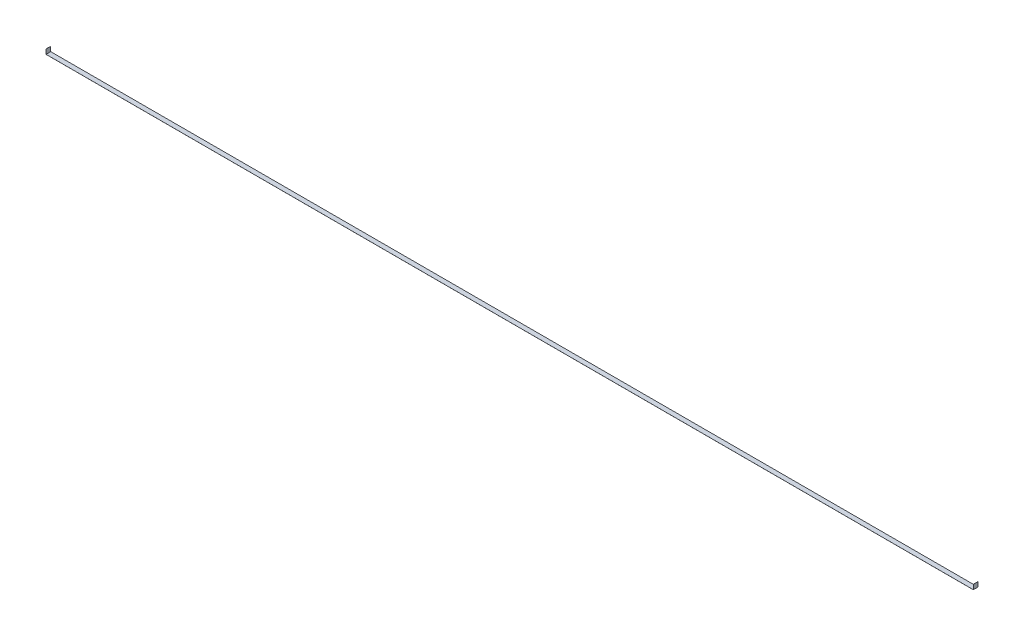
ISO-10303-21;
HEADER;
FILE_DESCRIPTION(('STEP AP214'),'2;1');
FILE_NAME('part.step','',(''),(''),'','','');
FILE_SCHEMA(('AUTOMOTIVE_DESIGN { 1 0 10303 214 1 1 1 1 }'));
ENDSEC;
DATA;
#1=APPLICATION_CONTEXT('core data for automotive mechanical design processes');
#2=APPLICATION_PROTOCOL_DEFINITION('international standard','automotive_design',2000,#1);
#3=PRODUCT_CONTEXT('',#1,'mechanical');
#4=PRODUCT('Part','Part','',(#3));
#5=PRODUCT_RELATED_PRODUCT_CATEGORY('part','',(#4));
#6=PRODUCT_DEFINITION_FORMATION('','',#4);
#7=PRODUCT_DEFINITION_CONTEXT('part definition',#1,'design');
#8=PRODUCT_DEFINITION('design','',#6,#7);
#9=PRODUCT_DEFINITION_SHAPE('','',#8);
#10=(LENGTH_UNIT() NAMED_UNIT(*) SI_UNIT(.MILLI.,.METRE.));
#11=(NAMED_UNIT(*) PLANE_ANGLE_UNIT() SI_UNIT($,.RADIAN.));
#12=(NAMED_UNIT(*) SI_UNIT($,.STERADIAN.) SOLID_ANGLE_UNIT());
#13=UNCERTAINTY_MEASURE_WITH_UNIT(LENGTH_MEASURE(1.E-05),#10,'distance_accuracy_value','');
#14=(GEOMETRIC_REPRESENTATION_CONTEXT(3) GLOBAL_UNCERTAINTY_ASSIGNED_CONTEXT((#13)) GLOBAL_UNIT_ASSIGNED_CONTEXT((#10,
#11,#12)) REPRESENTATION_CONTEXT('',''));
#15=CARTESIAN_POINT('',(0.,0.,0.));
#16=DIRECTION('',(0.,0.,1.));
#17=DIRECTION('',(1.,0.,0.));
#18=AXIS2_PLACEMENT_3D('',#15,#16,#17);
#19=CARTESIAN_POINT('',(-2527.3,0.,12.7));
#20=DIRECTION('',(-1.,0.,0.));
#21=DIRECTION('',(0.,0.,1.));
#22=AXIS2_PLACEMENT_3D('',#19,#20,#21);
#23=PLANE('',#22);
#24=DIRECTION('',(0.,1.,0.));
#25=VECTOR('',#24,1.);
#26=CARTESIAN_POINT('',(-2527.3,0.,-12.7));
#27=LINE('',#26,#25);
#28=CARTESIAN_POINT('',(-2527.3,0.,-12.7));
#29=VERTEX_POINT('',#28);
#30=CARTESIAN_POINT('',(-2527.3,25.4,-12.7));
#31=VERTEX_POINT('',#30);
#32=EDGE_CURVE('E134',#29,#31,#27,.T.);
#33=ORIENTED_EDGE('',*,*,#32,.T.);
#34=DIRECTION('',(0.,0.,-1.));
#35=VECTOR('',#34,1.);
#36=CARTESIAN_POINT('',(-2527.3,25.4,12.7));
#37=LINE('',#36,#35);
#38=CARTESIAN_POINT('',(-2527.3,25.4,12.7));
#39=VERTEX_POINT('',#38);
#40=EDGE_CURVE('E11',#39,#31,#37,.T.);
#41=ORIENTED_EDGE('',*,*,#40,.F.);
#42=DIRECTION('',(0.,1.,0.));
#43=VECTOR('',#42,1.);
#44=CARTESIAN_POINT('',(-2527.3,0.,12.7));
#45=LINE('',#44,#43);
#46=CARTESIAN_POINT('',(-2527.3,0.,12.7));
#47=VERTEX_POINT('',#46);
#48=EDGE_CURVE('E92',#47,#39,#45,.T.);
#49=ORIENTED_EDGE('',*,*,#48,.F.);
#50=DIRECTION('',(0.,0.,-1.));
#51=VECTOR('',#50,1.);
#52=CARTESIAN_POINT('',(-2527.3,0.,12.7));
#53=LINE('',#52,#51);
#54=EDGE_CURVE('E133',#47,#29,#53,.T.);
#55=ORIENTED_EDGE('',*,*,#54,.T.);
#56=EDGE_LOOP('',(#33,#41,#49,#55));
#57=FACE_BOUND('',#56,.T.);
#58=ADVANCED_FACE('F37',(#57),#23,.F.);
#59=CARTESIAN_POINT('',(-2527.554,25.4,12.7));
#60=DIRECTION('',(0.,1.,0.));
#61=DIRECTION('',(0.,0.,1.));
#62=AXIS2_PLACEMENT_3D('',#59,#60,#61);
#63=PLANE('',#62);
#64=DIRECTION('',(1.,0.,0.));
#65=VECTOR('',#64,1.);
#66=CARTESIAN_POINT('',(-2527.554,25.4,-12.7));
#67=LINE('',#66,#65);
#68=CARTESIAN_POINT('',(-2527.554,25.4,-12.7));
#69=VERTEX_POINT('',#68);
#70=EDGE_CURVE('E137',#69,#31,#67,.T.);
#71=ORIENTED_EDGE('',*,*,#70,.F.);
#72=DIRECTION('',(0.,0.,-1.));
#73=VECTOR('',#72,1.);
#74=CARTESIAN_POINT('',(-2527.554,25.4,12.7));
#75=LINE('',#74,#73);
#76=CARTESIAN_POINT('',(-2527.554,25.4,12.7));
#77=VERTEX_POINT('',#76);
#78=EDGE_CURVE('E45',#77,#69,#75,.T.);
#79=ORIENTED_EDGE('',*,*,#78,.F.);
#80=DIRECTION('',(1.,0.,0.));
#81=VECTOR('',#80,1.);
#82=CARTESIAN_POINT('',(-2527.554,25.4,12.7));
#83=LINE('',#82,#81);
#84=EDGE_CURVE('E176',#77,#39,#83,.T.);
#85=ORIENTED_EDGE('',*,*,#84,.T.);
#86=ORIENTED_EDGE('',*,*,#40,.T.);
#87=EDGE_LOOP('',(#71,#79,#85,#86));
#88=FACE_BOUND('',#87,.T.);
#89=ADVANCED_FACE('F167',(#88),#63,.T.);
#90=CARTESIAN_POINT('',(-2527.554,0.,12.7));
#91=DIRECTION('',(-1.,0.,0.));
#92=DIRECTION('',(0.,0.,1.));
#93=AXIS2_PLACEMENT_3D('',#90,#91,#92);
#94=PLANE('',#93);
#95=DIRECTION('',(0.,1.,0.));
#96=VECTOR('',#95,1.);
#97=CARTESIAN_POINT('',(-2527.554,0.,-12.7));
#98=LINE('',#97,#96);
#99=CARTESIAN_POINT('',(-2527.554,-0.254,-12.7));
#100=VERTEX_POINT('',#99);
#101=EDGE_CURVE('E140',#100,#69,#98,.T.);
#102=ORIENTED_EDGE('',*,*,#101,.F.);
#103=DIRECTION('',(0.,0.,-1.));
#104=VECTOR('',#103,1.);
#105=CARTESIAN_POINT('',(-2527.554,-0.254,12.7));
#106=LINE('',#105,#104);
#107=CARTESIAN_POINT('',(-2527.554,-0.254,12.7));
#108=VERTEX_POINT('',#107);
#109=EDGE_CURVE('E157',#108,#100,#106,.T.);
#110=ORIENTED_EDGE('',*,*,#109,.F.);
#111=DIRECTION('',(0.,1.,0.));
#112=VECTOR('',#111,1.);
#113=CARTESIAN_POINT('',(-2527.554,0.,12.7));
#114=LINE('',#113,#112);
#115=EDGE_CURVE('E164',#108,#77,#114,.T.);
#116=ORIENTED_EDGE('',*,*,#115,.T.);
#117=ORIENTED_EDGE('',*,*,#78,.T.);
#118=EDGE_LOOP('',(#102,#110,#116,#117));
#119=FACE_BOUND('',#118,.T.);
#120=ADVANCED_FACE('F162',(#119),#94,.T.);
#121=CARTESIAN_POINT('',(-2527.3,-0.254,12.7));
#122=DIRECTION('',(0.,-1.,0.));
#123=DIRECTION('',(1.,0.,0.));
#124=AXIS2_PLACEMENT_3D('',#121,#122,#123);
#125=PLANE('',#124);
#126=DIRECTION('',(-1.,0.,0.));
#127=VECTOR('',#126,1.);
#128=CARTESIAN_POINT('',(-2527.3,-0.254,-12.7));
#129=LINE('',#128,#127);
#130=CARTESIAN_POINT('',(2527.554,-0.253999999999071,-12.7));
#131=VERTEX_POINT('',#130);
#132=EDGE_CURVE('E143',#131,#100,#129,.T.);
#133=ORIENTED_EDGE('',*,*,#132,.F.);
#134=DIRECTION('',(0.,0.,-1.));
#135=VECTOR('',#134,1.);
#136=CARTESIAN_POINT('',(2527.554,-0.253999999999071,12.7));
#137=LINE('',#136,#135);
#138=CARTESIAN_POINT('',(2527.554,-0.253999999999071,12.7));
#139=VERTEX_POINT('',#138);
#140=EDGE_CURVE('E155',#139,#131,#137,.T.);
#141=ORIENTED_EDGE('',*,*,#140,.F.);
#142=DIRECTION('',(-1.,0.,0.));
#143=VECTOR('',#142,1.);
#144=CARTESIAN_POINT('',(-2527.3,-0.254,12.7));
#145=LINE('',#144,#143);
#146=EDGE_CURVE('E128',#139,#108,#145,.T.);
#147=ORIENTED_EDGE('',*,*,#146,.T.);
#148=ORIENTED_EDGE('',*,*,#109,.T.);
#149=EDGE_LOOP('',(#133,#141,#147,#148));
#150=FACE_BOUND('',#149,.T.);
#151=ADVANCED_FACE('F174',(#150),#125,.T.);
#152=CARTESIAN_POINT('',(2527.554,9.28514956645532E-13,12.7));
#153=DIRECTION('',(1.,0.,0.));
#154=DIRECTION('',(0.,0.,-1.));
#155=AXIS2_PLACEMENT_3D('',#152,#153,#154);
#156=PLANE('',#155);
#157=DIRECTION('',(0.,1.,0.));
#158=VECTOR('',#157,1.);
#159=CARTESIAN_POINT('',(2527.554,9.28514956645532E-13,-12.7));
#160=LINE('',#159,#158);
#161=CARTESIAN_POINT('',(2527.554,25.4000000000009,-12.7));
#162=VERTEX_POINT('',#161);
#163=EDGE_CURVE('E146',#162,#131,#160,.F.);
#164=ORIENTED_EDGE('',*,*,#163,.F.);
#165=DIRECTION('',(0.,0.,-1.));
#166=VECTOR('',#165,1.);
#167=CARTESIAN_POINT('',(2527.554,25.4000000000009,12.7));
#168=LINE('',#167,#166);
#169=CARTESIAN_POINT('',(2527.554,25.4000000000009,12.7));
#170=VERTEX_POINT('',#169);
#171=EDGE_CURVE('E116',#170,#162,#168,.T.);
#172=ORIENTED_EDGE('',*,*,#171,.F.);
#173=DIRECTION('',(0.,1.,0.));
#174=VECTOR('',#173,1.);
#175=CARTESIAN_POINT('',(2527.554,9.28514956645532E-13,12.7));
#176=LINE('',#175,#174);
#177=EDGE_CURVE('E126',#170,#139,#176,.F.);
#178=ORIENTED_EDGE('',*,*,#177,.T.);
#179=ORIENTED_EDGE('',*,*,#140,.T.);
#180=EDGE_LOOP('',(#164,#172,#178,#179));
#181=FACE_BOUND('',#180,.T.);
#182=ADVANCED_FACE('F181',(#181),#156,.T.);
#183=CARTESIAN_POINT('',(2527.3,25.4000000000009,12.7));
#184=DIRECTION('',(0.,1.,0.));
#185=DIRECTION('',(0.,0.,1.));
#186=AXIS2_PLACEMENT_3D('',#183,#184,#185);
#187=PLANE('',#186);
#188=DIRECTION('',(1.,0.,0.));
#189=VECTOR('',#188,1.);
#190=CARTESIAN_POINT('',(2527.3,25.4000000000009,-12.7));
#191=LINE('',#190,#189);
#192=CARTESIAN_POINT('',(2527.3,25.4000000000009,-12.7));
#193=VERTEX_POINT('',#192);
#194=EDGE_CURVE('E115',#193,#162,#191,.T.);
#195=ORIENTED_EDGE('',*,*,#194,.F.);
#196=DIRECTION('',(0.,0.,-1.));
#197=VECTOR('',#196,1.);
#198=CARTESIAN_POINT('',(2527.3,25.4000000000009,12.7));
#199=LINE('',#198,#197);
#200=CARTESIAN_POINT('',(2527.3,25.4000000000009,12.7));
#201=VERTEX_POINT('',#200);
#202=EDGE_CURVE('E109',#201,#193,#199,.T.);
#203=ORIENTED_EDGE('',*,*,#202,.F.);
#204=DIRECTION('',(1.,0.,0.));
#205=VECTOR('',#204,1.);
#206=CARTESIAN_POINT('',(2527.3,25.4000000000009,12.7));
#207=LINE('',#206,#205);
#208=EDGE_CURVE('E113',#201,#170,#207,.T.);
#209=ORIENTED_EDGE('',*,*,#208,.T.);
#210=ORIENTED_EDGE('',*,*,#171,.T.);
#211=EDGE_LOOP('',(#195,#203,#209,#210));
#212=FACE_BOUND('',#211,.T.);
#213=ADVANCED_FACE('F111',(#212),#187,.T.);
#214=CARTESIAN_POINT('',(2527.3,9.28514956645532E-13,12.7));
#215=DIRECTION('',(1.,0.,0.));
#216=DIRECTION('',(0.,0.,-1.));
#217=AXIS2_PLACEMENT_3D('',#214,#215,#216);
#218=PLANE('',#217);
#219=DIRECTION('',(0.,-1.,0.));
#220=VECTOR('',#219,1.);
#221=CARTESIAN_POINT('',(2527.3,9.28514956645532E-13,-12.7));
#222=LINE('',#221,#220);
#223=CARTESIAN_POINT('',(2527.3,9.28514956645532E-13,-12.7));
#224=VERTEX_POINT('',#223);
#225=EDGE_CURVE('E80',#193,#224,#222,.T.);
#226=ORIENTED_EDGE('',*,*,#225,.T.);
#227=DIRECTION('',(0.,0.,-1.));
#228=VECTOR('',#227,1.);
#229=CARTESIAN_POINT('',(2527.3,9.28514956645532E-13,12.7));
#230=LINE('',#229,#228);
#231=CARTESIAN_POINT('',(2527.3,9.28514956645532E-13,12.7));
#232=VERTEX_POINT('',#231);
#233=EDGE_CURVE('E117',#232,#224,#230,.T.);
#234=ORIENTED_EDGE('',*,*,#233,.F.);
#235=DIRECTION('',(0.,-1.,0.));
#236=VECTOR('',#235,1.);
#237=CARTESIAN_POINT('',(2527.3,9.28514956645532E-13,12.7));
#238=LINE('',#237,#236);
#239=EDGE_CURVE('E119',#201,#232,#238,.T.);
#240=ORIENTED_EDGE('',*,*,#239,.F.);
#241=ORIENTED_EDGE('',*,*,#202,.T.);
#242=EDGE_LOOP('',(#226,#234,#240,#241));
#243=FACE_BOUND('',#242,.T.);
#244=ADVANCED_FACE('F120',(#243),#218,.F.);
#245=CARTESIAN_POINT('',(-2527.3,0.,12.7));
#246=DIRECTION('',(0.,-1.,0.));
#247=DIRECTION('',(1.,0.,0.));
#248=AXIS2_PLACEMENT_3D('',#245,#246,#247);
#249=PLANE('',#248);
#250=DIRECTION('',(-1.,0.,0.));
#251=VECTOR('',#250,1.);
#252=CARTESIAN_POINT('',(-2527.3,0.,-12.7));
#253=LINE('',#252,#251);
#254=EDGE_CURVE('E86',#224,#29,#253,.T.);
#255=ORIENTED_EDGE('',*,*,#254,.T.);
#256=ORIENTED_EDGE('',*,*,#54,.F.);
#257=DIRECTION('',(-1.,0.,0.));
#258=VECTOR('',#257,1.);
#259=CARTESIAN_POINT('',(-2527.3,0.,12.7));
#260=LINE('',#259,#258);
#261=EDGE_CURVE('E53',#232,#47,#260,.T.);
#262=ORIENTED_EDGE('',*,*,#261,.F.);
#263=ORIENTED_EDGE('',*,*,#233,.T.);
#264=EDGE_LOOP('',(#255,#256,#262,#263));
#265=FACE_BOUND('',#264,.T.);
#266=ADVANCED_FACE('F183',(#265),#249,.F.);
#267=CARTESIAN_POINT('',(0.,0.,12.7));
#268=DIRECTION('',(0.,0.,-1.));
#269=DIRECTION('',(-1.,0.,0.));
#270=AXIS2_PLACEMENT_3D('',#267,#268,#269);
#271=PLANE('',#270);
#272=ORIENTED_EDGE('',*,*,#48,.T.);
#273=ORIENTED_EDGE('',*,*,#84,.F.);
#274=ORIENTED_EDGE('',*,*,#115,.F.);
#275=ORIENTED_EDGE('',*,*,#146,.F.);
#276=ORIENTED_EDGE('',*,*,#177,.F.);
#277=ORIENTED_EDGE('',*,*,#208,.F.);
#278=ORIENTED_EDGE('',*,*,#239,.T.);
#279=ORIENTED_EDGE('',*,*,#261,.T.);
#280=EDGE_LOOP('',(#272,#273,#274,#275,#276,#277,#278,#279));
#281=FACE_BOUND('',#280,.T.);
#282=ADVANCED_FACE('F123',(#281),#271,.F.);
#283=CARTESIAN_POINT('',(0.,0.,-12.7));
#284=DIRECTION('',(0.,0.,-1.));
#285=DIRECTION('',(-1.,0.,0.));
#286=AXIS2_PLACEMENT_3D('',#283,#284,#285);
#287=PLANE('',#286);
#288=ORIENTED_EDGE('',*,*,#32,.F.);
#289=ORIENTED_EDGE('',*,*,#254,.F.);
#290=ORIENTED_EDGE('',*,*,#225,.F.);
#291=ORIENTED_EDGE('',*,*,#194,.T.);
#292=ORIENTED_EDGE('',*,*,#163,.T.);
#293=ORIENTED_EDGE('',*,*,#132,.T.);
#294=ORIENTED_EDGE('',*,*,#101,.T.);
#295=ORIENTED_EDGE('',*,*,#70,.T.);
#296=EDGE_LOOP('',(#288,#289,#290,#291,#292,#293,#294,#295));
#297=FACE_BOUND('',#296,.T.);
#298=ADVANCED_FACE('F170',(#297),#287,.T.);
#299=CLOSED_SHELL('',(#58,#89,#120,#151,#182,#213,#244,#266,#282,#298));
#300=MANIFOLD_SOLID_BREP('B2',#299);
#301=ADVANCED_BREP_SHAPE_REPRESENTATION('',(#18,#300),#14);
#302=SHAPE_DEFINITION_REPRESENTATION(#9,#301);
ENDSEC;
END-ISO-10303-21;
